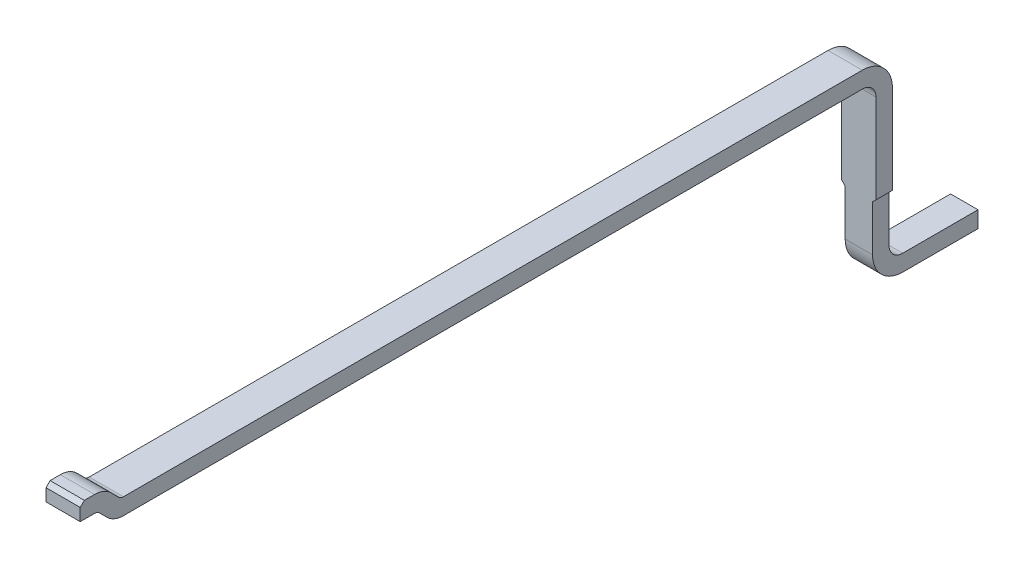
ISO-10303-21;
HEADER;
FILE_DESCRIPTION(('STEP AP214'),'2;1');
FILE_NAME('part.step','',(''),(''),'','','');
FILE_SCHEMA(('AUTOMOTIVE_DESIGN { 1 0 10303 214 1 1 1 1 }'));
ENDSEC;
DATA;
#1=APPLICATION_CONTEXT('core data for automotive mechanical design processes');
#2=APPLICATION_PROTOCOL_DEFINITION('international standard','automotive_design',2000,#1);
#3=PRODUCT_CONTEXT('',#1,'mechanical');
#4=PRODUCT('Part','Part','',(#3));
#5=PRODUCT_RELATED_PRODUCT_CATEGORY('part','',(#4));
#6=PRODUCT_DEFINITION_FORMATION('','',#4);
#7=PRODUCT_DEFINITION_CONTEXT('part definition',#1,'design');
#8=PRODUCT_DEFINITION('design','',#6,#7);
#9=PRODUCT_DEFINITION_SHAPE('','',#8);
#10=(LENGTH_UNIT() NAMED_UNIT(*) SI_UNIT(.MILLI.,.METRE.));
#11=(NAMED_UNIT(*) PLANE_ANGLE_UNIT() SI_UNIT($,.RADIAN.));
#12=(NAMED_UNIT(*) SI_UNIT($,.STERADIAN.) SOLID_ANGLE_UNIT());
#13=UNCERTAINTY_MEASURE_WITH_UNIT(LENGTH_MEASURE(1.E-05),#10,'distance_accuracy_value','');
#14=(GEOMETRIC_REPRESENTATION_CONTEXT(3) GLOBAL_UNCERTAINTY_ASSIGNED_CONTEXT((#13)) GLOBAL_UNIT_ASSIGNED_CONTEXT((#10,
#11,#12)) REPRESENTATION_CONTEXT('',''));
#15=CARTESIAN_POINT('',(0.,0.,0.));
#16=DIRECTION('',(0.,0.,1.));
#17=DIRECTION('',(1.,0.,0.));
#18=AXIS2_PLACEMENT_3D('',#15,#16,#17);
#19=CARTESIAN_POINT('',(0.,12.81951558355,0.));
#20=DIRECTION('',(0.,-1.,0.));
#21=DIRECTION('',(0.,0.,-1.));
#22=AXIS2_PLACEMENT_3D('',#19,#20,#21);
#23=PLANE('',#22);
#24=DIRECTION('',(0.,0.,-1.));
#25=VECTOR('',#24,1.);
#26=CARTESIAN_POINT('',(15.16210820689,12.81951558355,-5.731698833076));
#27=LINE('',#26,#25);
#28=CARTESIAN_POINT('',(15.1621082061497,12.81951558355,-5.77711513867904));
#29=VERTEX_POINT('',#28);
#30=CARTESIAN_POINT('',(15.1621081757249,12.81951558355,-11.17169883308));
#31=VERTEX_POINT('',#30);
#32=EDGE_CURVE('E332',#29,#31,#27,.T.);
#33=ORIENTED_EDGE('',*,*,#32,.T.);
#34=DIRECTION('',(1.,0.,0.));
#35=VECTOR('',#34,1.);
#36=CARTESIAN_POINT('',(0.,12.81951558355,-11.17169883308));
#37=LINE('',#36,#35);
#38=CARTESIAN_POINT('',(15.4121081757445,12.81951558355,-11.17169883308));
#39=VERTEX_POINT('',#38);
#40=EDGE_CURVE('E370',#31,#39,#37,.T.);
#41=ORIENTED_EDGE('',*,*,#40,.T.);
#42=DIRECTION('',(0.,0.,-1.));
#43=VECTOR('',#42,1.);
#44=CARTESIAN_POINT('',(15.41210820689,12.81951558355,-12.98169883308));
#45=LINE('',#44,#43);
#46=CARTESIAN_POINT('',(15.4121082061497,12.81951558355,-5.77711513867904));
#47=VERTEX_POINT('',#46);
#48=EDGE_CURVE('E427',#47,#39,#45,.T.);
#49=ORIENTED_EDGE('',*,*,#48,.F.);
#50=DIRECTION('',(-1.,0.,0.));
#51=VECTOR('',#50,1.);
#52=CARTESIAN_POINT('',(0.,12.81951558355,-5.777115138679));
#53=LINE('',#52,#51);
#54=EDGE_CURVE('E41',#47,#29,#53,.T.);
#55=ORIENTED_EDGE('',*,*,#54,.T.);
#56=EDGE_LOOP('',(#33,#41,#49,#55));
#57=FACE_BOUND('',#56,.T.);
#58=ADVANCED_FACE('F17',(#57),#23,.T.);
#59=CARTESIAN_POINT('',(12.51210817501,12.93951558355,-11.38169883308));
#60=DIRECTION('',(0.,-1.,0.));
#61=DIRECTION('',(0.,0.,-1.));
#62=AXIS2_PLACEMENT_3D('',#59,#60,#61);
#63=PLANE('',#62);
#64=DIRECTION('',(0.,0.,-1.));
#65=VECTOR('',#64,1.);
#66=CARTESIAN_POINT('',(15.16210820689,12.93951558355,-11.38169883308));
#67=LINE('',#66,#65);
#68=CARTESIAN_POINT('',(15.1621082061497,12.93951558355,-5.77711513867901));
#69=VERTEX_POINT('',#68);
#70=CARTESIAN_POINT('',(15.1621081757249,12.93951558355,-11.17169883308));
#71=VERTEX_POINT('',#70);
#72=EDGE_CURVE('E374',#69,#71,#67,.T.);
#73=ORIENTED_EDGE('',*,*,#72,.F.);
#74=DIRECTION('',(-1.,0.,0.));
#75=VECTOR('',#74,1.);
#76=CARTESIAN_POINT('',(12.51210817501,12.93951558355,-5.777115138679));
#77=LINE('',#76,#75);
#78=CARTESIAN_POINT('',(15.4121082061497,12.93951558355,-5.77711513867901));
#79=VERTEX_POINT('',#78);
#80=EDGE_CURVE('E11',#79,#69,#77,.T.);
#81=ORIENTED_EDGE('',*,*,#80,.F.);
#82=DIRECTION('',(0.,0.,1.));
#83=VECTOR('',#82,1.);
#84=CARTESIAN_POINT('',(15.41210820689,12.93951558355,-12.98169883308));
#85=LINE('',#84,#83);
#86=CARTESIAN_POINT('',(15.4121081757445,12.93951558355,-11.17169883308));
#87=VERTEX_POINT('',#86);
#88=EDGE_CURVE('E286',#87,#79,#85,.T.);
#89=ORIENTED_EDGE('',*,*,#88,.F.);
#90=DIRECTION('',(-1.,0.,0.));
#91=VECTOR('',#90,1.);
#92=CARTESIAN_POINT('',(13.11210817501,12.93951558355,-11.17169883308));
#93=LINE('',#92,#91);
#94=EDGE_CURVE('E423',#87,#71,#93,.T.);
#95=ORIENTED_EDGE('',*,*,#94,.T.);
#96=EDGE_LOOP('',(#73,#81,#89,#95));
#97=FACE_BOUND('',#96,.T.);
#98=ADVANCED_FACE('F761',(#97),#63,.F.);
#99=CARTESIAN_POINT('',(12.51210817501,12.98951558355,-5.777115138679));
#100=DIRECTION('',(1.,0.,0.));
#101=DIRECTION('',(0.,0.,1.));
#102=AXIS2_PLACEMENT_3D('',#99,#100,#101);
#103=CYLINDRICAL_SURFACE('',#102,0.05);
#104=ORIENTED_EDGE('',*,*,#80,.T.);
#105=CARTESIAN_POINT('',(15.16210820689,12.98951558355,-5.777115138679));
#106=DIRECTION('',(-1.,0.,0.));
#107=DIRECTION('',(0.,0.,1.));
#108=AXIS2_PLACEMENT_3D('',#105,#106,#107);
#109=CIRCLE('',#108,0.05);
#110=CARTESIAN_POINT('',(15.1621082061497,12.9541602444904,-5.74175979962039));
#111=VERTEX_POINT('',#110);
#112=EDGE_CURVE('E363',#69,#111,#109,.T.);
#113=ORIENTED_EDGE('',*,*,#112,.T.);
#114=DIRECTION('',(-1.,0.,0.));
#115=VECTOR('',#114,1.);
#116=CARTESIAN_POINT('',(16.91210820408,12.954160244491,-5.741759799621));
#117=LINE('',#116,#115);
#118=CARTESIAN_POINT('',(15.4121082061497,12.9541602444904,-5.74175979962039));
#119=VERTEX_POINT('',#118);
#120=EDGE_CURVE('E27',#119,#111,#117,.T.);
#121=ORIENTED_EDGE('',*,*,#120,.F.);
#122=CARTESIAN_POINT('',(15.41210820689,12.98951558355,-5.777115138679));
#123=DIRECTION('',(-1.,0.,0.));
#124=DIRECTION('',(0.,0.,1.));
#125=AXIS2_PLACEMENT_3D('',#122,#123,#124);
#126=CIRCLE('',#125,0.05);
#127=EDGE_CURVE('E281',#79,#119,#126,.T.);
#128=ORIENTED_EDGE('',*,*,#127,.F.);
#129=EDGE_LOOP('',(#104,#113,#121,#128));
#130=FACE_BOUND('',#129,.T.);
#131=ADVANCED_FACE('F745',(#130),#103,.F.);
#132=CARTESIAN_POINT('',(16.91210820408,12.93951558355,-5.756404460561));
#133=DIRECTION('',(0.,0.707106781186548,-0.707106781186548));
#134=DIRECTION('',(-1.,0.,0.));
#135=AXIS2_PLACEMENT_3D('',#132,#133,#134);
#136=PLANE('',#135);
#137=DIRECTION('',(-1.,0.,0.));
#138=VECTOR('',#137,1.);
#139=CARTESIAN_POINT('',(16.91210820408,13.009723736351,-5.68619630776));
#140=LINE('',#139,#138);
#141=CARTESIAN_POINT('',(15.4121082061497,13.0097237363508,-5.68619630775936));
#142=VERTEX_POINT('',#141);
#143=CARTESIAN_POINT('',(15.1621082061497,13.0097237363508,-5.68619630775937));
#144=VERTEX_POINT('',#143);
#145=EDGE_CURVE('E152',#142,#144,#140,.T.);
#146=ORIENTED_EDGE('',*,*,#145,.F.);
#147=DIRECTION('',(0.,0.707106781180048,0.707106781193047));
#148=VECTOR('',#147,1.);
#149=CARTESIAN_POINT('',(15.41210820689,12.95416024449,-5.74175979962));
#150=LINE('',#149,#148);
#151=EDGE_CURVE('E285',#119,#142,#150,.T.);
#152=ORIENTED_EDGE('',*,*,#151,.F.);
#153=ORIENTED_EDGE('',*,*,#120,.T.);
#154=DIRECTION('',(0.,0.707106781180048,0.707106781193047));
#155=VECTOR('',#154,1.);
#156=CARTESIAN_POINT('',(15.16210820689,12.95416024449,-5.74175979962));
#157=LINE('',#156,#155);
#158=EDGE_CURVE('E335',#111,#144,#157,.T.);
#159=ORIENTED_EDGE('',*,*,#158,.T.);
#160=EDGE_LOOP('',(#146,#152,#153,#159));
#161=FACE_BOUND('',#160,.T.);
#162=ADVANCED_FACE('F741',(#161),#136,.T.);
#163=CARTESIAN_POINT('',(16.91210820408,12.88951558355,-5.565988154957));
#164=DIRECTION('',(1.,0.,0.));
#165=DIRECTION('',(0.,0.,1.));
#166=AXIS2_PLACEMENT_3D('',#163,#164,#165);
#167=CYLINDRICAL_SURFACE('',#166,0.17);
#168=DIRECTION('',(-1.,0.,0.));
#169=VECTOR('',#168,1.);
#170=CARTESIAN_POINT('',(16.91210820408,13.05951558355,-5.565988154957));
#171=LINE('',#170,#169);
#172=CARTESIAN_POINT('',(15.4121082061497,13.05951558355,-5.565988154957));
#173=VERTEX_POINT('',#172);
#174=CARTESIAN_POINT('',(15.1621082061497,13.05951558355,-5.56598815495699));
#175=VERTEX_POINT('',#174);
#176=EDGE_CURVE('E163',#173,#175,#171,.T.);
#177=ORIENTED_EDGE('',*,*,#176,.F.);
#178=CARTESIAN_POINT('',(15.41210820689,12.88951558355,-5.565988154957));
#179=DIRECTION('',(1.,0.,0.));
#180=DIRECTION('',(0.,0.,1.));
#181=AXIS2_PLACEMENT_3D('',#178,#179,#180);
#182=CIRCLE('',#181,0.17);
#183=EDGE_CURVE('E342',#142,#173,#182,.T.);
#184=ORIENTED_EDGE('',*,*,#183,.F.);
#185=ORIENTED_EDGE('',*,*,#145,.T.);
#186=CARTESIAN_POINT('',(15.16210820689,12.88951558355,-5.565988154957));
#187=DIRECTION('',(1.,0.,0.));
#188=DIRECTION('',(0.,0.,1.));
#189=AXIS2_PLACEMENT_3D('',#186,#187,#188);
#190=CIRCLE('',#189,0.17);
#191=EDGE_CURVE('E264',#144,#175,#190,.T.);
#192=ORIENTED_EDGE('',*,*,#191,.T.);
#193=EDGE_LOOP('',(#177,#184,#185,#192));
#194=FACE_BOUND('',#193,.T.);
#195=ADVANCED_FACE('F747',(#194),#167,.T.);
#196=CARTESIAN_POINT('',(16.91210820408,13.05951558355,-5.661404460561));
#197=DIRECTION('',(0.,1.,0.));
#198=DIRECTION('',(1.,0.,0.));
#199=AXIS2_PLACEMENT_3D('',#196,#197,#198);
#200=PLANE('',#199);
#201=ORIENTED_EDGE('',*,*,#176,.T.);
#202=DIRECTION('',(0.,0.,1.));
#203=VECTOR('',#202,1.);
#204=CARTESIAN_POINT('',(15.16210820689,13.05951558355,-5.731698833076));
#205=LINE('',#204,#203);
#206=CARTESIAN_POINT('',(15.1621082061497,13.05951558355,-5.491404460561));
#207=VERTEX_POINT('',#206);
#208=EDGE_CURVE('E259',#175,#207,#205,.T.);
#209=ORIENTED_EDGE('',*,*,#208,.T.);
#210=DIRECTION('',(1.,0.,0.));
#211=VECTOR('',#210,1.);
#212=CARTESIAN_POINT('',(16.91210820408,13.05951558355,-5.491404460561));
#213=LINE('',#212,#211);
#214=CARTESIAN_POINT('',(15.4121082061497,13.05951558355,-5.491404460561));
#215=VERTEX_POINT('',#214);
#216=EDGE_CURVE('E246',#207,#215,#213,.T.);
#217=ORIENTED_EDGE('',*,*,#216,.T.);
#218=DIRECTION('',(0.,0.,1.));
#219=VECTOR('',#218,1.);
#220=CARTESIAN_POINT('',(15.41210820689,13.05951558355,-12.98169883308));
#221=LINE('',#220,#219);
#222=EDGE_CURVE('E346',#173,#215,#221,.T.);
#223=ORIENTED_EDGE('',*,*,#222,.F.);
#224=EDGE_LOOP('',(#201,#209,#217,#223));
#225=FACE_BOUND('',#224,.T.);
#226=ADVANCED_FACE('F260',(#225),#200,.T.);
#227=CARTESIAN_POINT('',(16.91210820408,13.05951558355,-5.491404460561));
#228=DIRECTION('',(0.,-0.707106781187048,-0.707106781186048));
#229=DIRECTION('',(0.,0.707106781186048,-0.707106781187048));
#230=AXIS2_PLACEMENT_3D('',#227,#228,#229);
#231=PLANE('',#230);
#232=DIRECTION('',(-1.,0.,0.));
#233=VECTOR('',#232,1.);
#234=CARTESIAN_POINT('',(16.91210820408,13.02951558355,-5.461404460561));
#235=LINE('',#234,#233);
#236=CARTESIAN_POINT('',(15.4121082061497,13.02951558355,-5.461404460561));
#237=VERTEX_POINT('',#236);
#238=CARTESIAN_POINT('',(15.1621082061497,13.02951558355,-5.461404460561));
#239=VERTEX_POINT('',#238);
#240=EDGE_CURVE('E240',#237,#239,#235,.T.);
#241=ORIENTED_EDGE('',*,*,#240,.F.);
#242=DIRECTION('',(0.,-0.707106781186548,0.707106781186548));
#243=VECTOR('',#242,1.);
#244=CARTESIAN_POINT('',(15.41210820689,13.05951558355,-5.491404460561));
#245=LINE('',#244,#243);
#246=EDGE_CURVE('E253',#215,#237,#245,.T.);
#247=ORIENTED_EDGE('',*,*,#246,.F.);
#248=ORIENTED_EDGE('',*,*,#216,.F.);
#249=DIRECTION('',(0.,-0.707106781186548,0.707106781186548));
#250=VECTOR('',#249,1.);
#251=CARTESIAN_POINT('',(15.16210820689,13.05951558355,-5.491404460561));
#252=LINE('',#251,#250);
#253=EDGE_CURVE('E250',#207,#239,#252,.T.);
#254=ORIENTED_EDGE('',*,*,#253,.T.);
#255=EDGE_LOOP('',(#241,#247,#248,#254));
#256=FACE_BOUND('',#255,.T.);
#257=ADVANCED_FACE('F248',(#256),#231,.F.);
#258=CARTESIAN_POINT('',(16.91210820408,13.05951558355,-5.461404460561));
#259=DIRECTION('',(0.,0.,1.));
#260=DIRECTION('',(1.,0.,0.));
#261=AXIS2_PLACEMENT_3D('',#258,#259,#260);
#262=PLANE('',#261);
#263=DIRECTION('',(1.,0.,0.));
#264=VECTOR('',#263,1.);
#265=CARTESIAN_POINT('',(17.5653424523,12.93951558355,-5.461404460561));
#266=LINE('',#265,#264);
#267=CARTESIAN_POINT('',(15.1621082061497,12.93951558355,-5.46140446056099));
#268=VERTEX_POINT('',#267);
#269=CARTESIAN_POINT('',(15.4121082061497,12.93951558355,-5.461404460561));
#270=VERTEX_POINT('',#269);
#271=EDGE_CURVE('E304',#268,#270,#266,.T.);
#272=ORIENTED_EDGE('',*,*,#271,.T.);
#273=DIRECTION('',(0.,-1.,0.));
#274=VECTOR('',#273,1.);
#275=CARTESIAN_POINT('',(15.41210820689,12.65951558355,-5.461404460561));
#276=LINE('',#275,#274);
#277=EDGE_CURVE('E390',#237,#270,#276,.T.);
#278=ORIENTED_EDGE('',*,*,#277,.F.);
#279=ORIENTED_EDGE('',*,*,#240,.T.);
#280=DIRECTION('',(0.,-1.,0.));
#281=VECTOR('',#280,1.);
#282=CARTESIAN_POINT('',(15.16210820689,12.93951558355,-5.461404460561));
#283=LINE('',#282,#281);
#284=EDGE_CURVE('E269',#239,#268,#283,.T.);
#285=ORIENTED_EDGE('',*,*,#284,.T.);
#286=EDGE_LOOP('',(#272,#278,#279,#285));
#287=FACE_BOUND('',#286,.T.);
#288=ADVANCED_FACE('F505',(#287),#262,.T.);
#289=CARTESIAN_POINT('',(17.5653424523,12.93951558355,-5.535988154957));
#290=DIRECTION('',(0.,1.,-1.444831928366E-13));
#291=DIRECTION('',(0.,-1.444831928366E-13,-1.));
#292=AXIS2_PLACEMENT_3D('',#289,#290,#291);
#293=PLANE('',#292);
#294=DIRECTION('',(0.,0.,-1.));
#295=VECTOR('',#294,1.);
#296=CARTESIAN_POINT('',(15.41210820689,12.93951558355,-12.98169883308));
#297=LINE('',#296,#295);
#298=CARTESIAN_POINT('',(15.4121082061497,12.93951558355,-5.565988154957));
#299=VERTEX_POINT('',#298);
#300=EDGE_CURVE('E341',#270,#299,#297,.T.);
#301=ORIENTED_EDGE('',*,*,#300,.F.);
#302=ORIENTED_EDGE('',*,*,#271,.F.);
#303=DIRECTION('',(0.,0.,-1.));
#304=VECTOR('',#303,1.);
#305=CARTESIAN_POINT('',(15.16210820689,12.93951558355,-5.731698833076));
#306=LINE('',#305,#304);
#307=CARTESIAN_POINT('',(15.1621082061497,12.93951558355,-5.56598815495699));
#308=VERTEX_POINT('',#307);
#309=EDGE_CURVE('E276',#268,#308,#306,.T.);
#310=ORIENTED_EDGE('',*,*,#309,.T.);
#311=DIRECTION('',(1.,0.,0.));
#312=VECTOR('',#311,1.);
#313=CARTESIAN_POINT('',(16.91210820408,12.93951558355,-5.565988154957));
#314=LINE('',#313,#312);
#315=EDGE_CURVE('E290',#308,#299,#314,.T.);
#316=ORIENTED_EDGE('',*,*,#315,.T.);
#317=EDGE_LOOP('',(#301,#302,#310,#316));
#318=FACE_BOUND('',#317,.T.);
#319=ADVANCED_FACE('F501',(#318),#293,.F.);
#320=CARTESIAN_POINT('',(16.91210820408,12.88951558355,-5.565988154957));
#321=DIRECTION('',(1.,0.,0.));
#322=DIRECTION('',(0.,0.,1.));
#323=AXIS2_PLACEMENT_3D('',#320,#321,#322);
#324=CYLINDRICAL_SURFACE('',#323,0.05);
#325=ORIENTED_EDGE('',*,*,#315,.F.);
#326=CARTESIAN_POINT('',(15.16210820689,12.88951558355,-5.565988154957));
#327=DIRECTION('',(-1.,0.,0.));
#328=DIRECTION('',(0.,0.,1.));
#329=AXIS2_PLACEMENT_3D('',#326,#327,#328);
#330=CIRCLE('',#329,0.05);
#331=CARTESIAN_POINT('',(15.1621082061497,12.9248709226098,-5.60134349401677));
#332=VERTEX_POINT('',#331);
#333=EDGE_CURVE('E386',#308,#332,#330,.T.);
#334=ORIENTED_EDGE('',*,*,#333,.T.);
#335=DIRECTION('',(-1.,0.,0.));
#336=VECTOR('',#335,1.);
#337=CARTESIAN_POINT('',(16.91210820408,12.92487092261,-5.601343494017));
#338=LINE('',#337,#336);
#339=CARTESIAN_POINT('',(15.4121082061497,12.9248709226098,-5.60134349401677));
#340=VERTEX_POINT('',#339);
#341=EDGE_CURVE('E287',#340,#332,#338,.T.);
#342=ORIENTED_EDGE('',*,*,#341,.F.);
#343=CARTESIAN_POINT('',(15.41210820689,12.88951558355,-5.565988154957));
#344=DIRECTION('',(-1.,0.,0.));
#345=DIRECTION('',(0.,0.,1.));
#346=AXIS2_PLACEMENT_3D('',#343,#344,#345);
#347=CIRCLE('',#346,0.05);
#348=EDGE_CURVE('E336',#299,#340,#347,.T.);
#349=ORIENTED_EDGE('',*,*,#348,.F.);
#350=EDGE_LOOP('',(#325,#334,#342,#349));
#351=FACE_BOUND('',#350,.T.);
#352=ADVANCED_FACE('F788',(#351),#324,.F.);
#353=CARTESIAN_POINT('',(16.91210820408,12.93951558355,-5.586698833076));
#354=DIRECTION('',(0.,-0.707106781186048,0.707106781187048));
#355=DIRECTION('',(-1.,0.,0.));
#356=AXIS2_PLACEMENT_3D('',#353,#354,#355);
#357=PLANE('',#356);
#358=ORIENTED_EDGE('',*,*,#341,.T.);
#359=DIRECTION('',(0.,-0.707106781180048,-0.707106781193047));
#360=VECTOR('',#359,1.);
#361=CARTESIAN_POINT('',(15.16210820689,12.92487092261,-5.601343494017));
#362=LINE('',#361,#360);
#363=CARTESIAN_POINT('',(15.1621082061497,12.8693074307492,-5.65690698587737));
#364=VERTEX_POINT('',#363);
#365=EDGE_CURVE('E331',#332,#364,#362,.T.);
#366=ORIENTED_EDGE('',*,*,#365,.T.);
#367=DIRECTION('',(-1.,0.,0.));
#368=VECTOR('',#367,1.);
#369=CARTESIAN_POINT('',(13.06210817501,12.869307430749,-5.656906985877));
#370=LINE('',#369,#368);
#371=CARTESIAN_POINT('',(15.4121082061497,12.8693074307492,-5.65690698587737));
#372=VERTEX_POINT('',#371);
#373=EDGE_CURVE('E20',#372,#364,#370,.T.);
#374=ORIENTED_EDGE('',*,*,#373,.F.);
#375=DIRECTION('',(0.,-0.707106781180048,-0.707106781193047));
#376=VECTOR('',#375,1.);
#377=CARTESIAN_POINT('',(15.41210820689,12.92487092261,-5.601343494017));
#378=LINE('',#377,#376);
#379=EDGE_CURVE('E340',#340,#372,#378,.T.);
#380=ORIENTED_EDGE('',*,*,#379,.F.);
#381=EDGE_LOOP('',(#358,#366,#374,#380));
#382=FACE_BOUND('',#381,.T.);
#383=ADVANCED_FACE('F786',(#382),#357,.T.);
#384=CARTESIAN_POINT('',(13.06210817501,12.98951558355,-5.777115138679));
#385=DIRECTION('',(1.,0.,0.));
#386=DIRECTION('',(0.,0.,1.));
#387=AXIS2_PLACEMENT_3D('',#384,#385,#386);
#388=CYLINDRICAL_SURFACE('',#387,0.17);
#389=ORIENTED_EDGE('',*,*,#54,.F.);
#390=CARTESIAN_POINT('',(15.41210820689,12.98951558355,-5.777115138679));
#391=DIRECTION('',(1.,0.,0.));
#392=DIRECTION('',(0.,0.,1.));
#393=AXIS2_PLACEMENT_3D('',#390,#391,#392);
#394=CIRCLE('',#393,0.17);
#395=EDGE_CURVE('E445',#372,#47,#394,.T.);
#396=ORIENTED_EDGE('',*,*,#395,.F.);
#397=ORIENTED_EDGE('',*,*,#373,.T.);
#398=CARTESIAN_POINT('',(15.16210820689,12.98951558355,-5.777115138679));
#399=DIRECTION('',(1.,0.,0.));
#400=DIRECTION('',(0.,0.,1.));
#401=AXIS2_PLACEMENT_3D('',#398,#399,#400);
#402=CIRCLE('',#401,0.17);
#403=EDGE_CURVE('E328',#364,#29,#402,.T.);
#404=ORIENTED_EDGE('',*,*,#403,.T.);
#405=EDGE_LOOP('',(#389,#396,#397,#404));
#406=FACE_BOUND('',#405,.T.);
#407=ADVANCED_FACE('F784',(#406),#388,.T.);
#408=CARTESIAN_POINT('',(12.81210814532,12.71951558355,-11.17169883308));
#409=DIRECTION('',(1.,0.,0.));
#410=DIRECTION('',(0.,0.,1.));
#411=AXIS2_PLACEMENT_3D('',#408,#409,#410);
#412=CYLINDRICAL_SURFACE('',#411,0.22);
#413=ORIENTED_EDGE('',*,*,#94,.F.);
#414=CARTESIAN_POINT('',(15.41210814532,12.71951558355,-11.17169883308));
#415=DIRECTION('',(-1.,0.,0.));
#416=DIRECTION('',(0.,0.,1.));
#417=AXIS2_PLACEMENT_3D('',#414,#415,#416);
#418=CIRCLE('',#417,0.22);
#419=CARTESIAN_POINT('',(15.41210814532,12.71951558355,-11.39169883308));
#420=VERTEX_POINT('',#419);
#421=EDGE_CURVE('E359',#87,#420,#418,.T.);
#422=ORIENTED_EDGE('',*,*,#421,.T.);
#423=DIRECTION('',(-1.,0.,0.));
#424=VECTOR('',#423,1.);
#425=CARTESIAN_POINT('',(12.81210814532,12.71951558355,-11.39169883308));
#426=LINE('',#425,#424);
#427=CARTESIAN_POINT('',(15.16210814532,12.71951558355,-11.39169883308));
#428=VERTEX_POINT('',#427);
#429=EDGE_CURVE('E395',#420,#428,#426,.T.);
#430=ORIENTED_EDGE('',*,*,#429,.T.);
#431=CARTESIAN_POINT('',(15.16210814532,12.71951558355,-11.17169883308));
#432=DIRECTION('',(-1.,0.,0.));
#433=DIRECTION('',(0.,0.,1.));
#434=AXIS2_PLACEMENT_3D('',#431,#432,#433);
#435=CIRCLE('',#434,0.22);
#436=EDGE_CURVE('E418',#71,#428,#435,.T.);
#437=ORIENTED_EDGE('',*,*,#436,.F.);
#438=EDGE_LOOP('',(#413,#422,#430,#437));
#439=FACE_BOUND('',#438,.T.);
#440=ADVANCED_FACE('F800',(#439),#412,.T.);
#441=CARTESIAN_POINT('',(15.41210814532,12.93951558355,-10.71169883308));
#442=DIRECTION('',(1.,0.,0.));
#443=DIRECTION('',(0.,0.,-1.));
#444=AXIS2_PLACEMENT_3D('',#441,#442,#443);
#445=PLANE('',#444);
#446=ORIENTED_EDGE('',*,*,#421,.F.);
#447=ORIENTED_EDGE('',*,*,#88,.T.);
#448=ORIENTED_EDGE('',*,*,#127,.T.);
#449=ORIENTED_EDGE('',*,*,#151,.T.);
#450=ORIENTED_EDGE('',*,*,#183,.T.);
#451=ORIENTED_EDGE('',*,*,#222,.T.);
#452=ORIENTED_EDGE('',*,*,#246,.T.);
#453=ORIENTED_EDGE('',*,*,#277,.T.);
#454=ORIENTED_EDGE('',*,*,#300,.T.);
#455=ORIENTED_EDGE('',*,*,#348,.T.);
#456=ORIENTED_EDGE('',*,*,#379,.T.);
#457=ORIENTED_EDGE('',*,*,#395,.T.);
#458=ORIENTED_EDGE('',*,*,#48,.T.);
#459=CARTESIAN_POINT('',(15.41210814532,12.71951558355,-11.17169883308));
#460=DIRECTION('',(-1.,0.,0.));
#461=DIRECTION('',(0.,0.,-1.));
#462=AXIS2_PLACEMENT_3D('',#459,#460,#461);
#463=CIRCLE('',#462,0.1);
#464=CARTESIAN_POINT('',(15.41210814532,12.71951558355,-11.27169883308));
#465=VERTEX_POINT('',#464);
#466=EDGE_CURVE('E326',#39,#465,#463,.T.);
#467=ORIENTED_EDGE('',*,*,#466,.T.);
#468=DIRECTION('',(0.,-1.,0.));
#469=VECTOR('',#468,1.);
#470=CARTESIAN_POINT('',(15.41210814532,12.93951558355,-11.27169883308));
#471=LINE('',#470,#469);
#472=CARTESIAN_POINT('',(15.41210814532,12.06951558355,-11.27169883308));
#473=VERTEX_POINT('',#472);
#474=EDGE_CURVE('E309',#465,#473,#471,.T.);
#475=ORIENTED_EDGE('',*,*,#474,.T.);
#476=DIRECTION('',(0.,0.,-1.));
#477=VECTOR('',#476,1.);
#478=CARTESIAN_POINT('',(15.41210814532,12.06951558355,-10.71169883308));
#479=LINE('',#478,#477);
#480=CARTESIAN_POINT('',(15.41210814532,12.06951558355,-11.39169883308));
#481=VERTEX_POINT('',#480);
#482=EDGE_CURVE('E310',#473,#481,#479,.T.);
#483=ORIENTED_EDGE('',*,*,#482,.T.);
#484=DIRECTION('',(0.,1.,0.));
#485=VECTOR('',#484,1.);
#486=CARTESIAN_POINT('',(15.41210814532,12.93951558355,-11.39169883308));
#487=LINE('',#486,#485);
#488=EDGE_CURVE('E466',#481,#420,#487,.T.);
#489=ORIENTED_EDGE('',*,*,#488,.T.);
#490=EDGE_LOOP('',(#446,#447,#448,#449,#450,#451,#452,#453,#454,#455,#456,#457,#458,#467,#475,
#483,#489));
#491=FACE_BOUND('',#490,.T.);
#492=ADVANCED_FACE('F498',(#491),#445,.T.);
#493=CARTESIAN_POINT('',(15.16210814532,12.93951558355,-11.91169883308));
#494=DIRECTION('',(-1.,0.,0.));
#495=DIRECTION('',(0.,1.,0.));
#496=AXIS2_PLACEMENT_3D('',#493,#494,#495);
#497=PLANE('',#496);
#498=ORIENTED_EDGE('',*,*,#72,.T.);
#499=ORIENTED_EDGE('',*,*,#436,.T.);
#500=DIRECTION('',(0.,-1.,0.));
#501=VECTOR('',#500,1.);
#502=CARTESIAN_POINT('',(15.16210814532,12.93951558355,-11.39169883308));
#503=LINE('',#502,#501);
#504=CARTESIAN_POINT('',(15.16210814532,12.06951558355,-11.39169883308));
#505=VERTEX_POINT('',#504);
#506=EDGE_CURVE('E403',#428,#505,#503,.T.);
#507=ORIENTED_EDGE('',*,*,#506,.T.);
#508=DIRECTION('',(0.,0.,1.));
#509=VECTOR('',#508,1.);
#510=CARTESIAN_POINT('',(15.16210814532,12.06951558355,-11.91169883308));
#511=LINE('',#510,#509);
#512=CARTESIAN_POINT('',(15.16210814532,12.06951558355,-11.27169883308));
#513=VERTEX_POINT('',#512);
#514=EDGE_CURVE('E295',#505,#513,#511,.T.);
#515=ORIENTED_EDGE('',*,*,#514,.T.);
#516=DIRECTION('',(0.,1.,0.));
#517=VECTOR('',#516,1.);
#518=CARTESIAN_POINT('',(15.16210814532,12.93951558355,-11.27169883308));
#519=LINE('',#518,#517);
#520=CARTESIAN_POINT('',(15.16210814532,12.71951558355,-11.27169883308));
#521=VERTEX_POINT('',#520);
#522=EDGE_CURVE('E327',#513,#521,#519,.T.);
#523=ORIENTED_EDGE('',*,*,#522,.T.);
#524=CARTESIAN_POINT('',(15.16210814532,12.71951558355,-11.17169883308));
#525=DIRECTION('',(1.,0.,0.));
#526=DIRECTION('',(0.,0.,-1.));
#527=AXIS2_PLACEMENT_3D('',#524,#525,#526);
#528=CIRCLE('',#527,0.1);
#529=EDGE_CURVE('E322',#521,#31,#528,.T.);
#530=ORIENTED_EDGE('',*,*,#529,.T.);
#531=ORIENTED_EDGE('',*,*,#32,.F.);
#532=ORIENTED_EDGE('',*,*,#403,.F.);
#533=ORIENTED_EDGE('',*,*,#365,.F.);
#534=ORIENTED_EDGE('',*,*,#333,.F.);
#535=ORIENTED_EDGE('',*,*,#309,.F.);
#536=ORIENTED_EDGE('',*,*,#284,.F.);
#537=ORIENTED_EDGE('',*,*,#253,.F.);
#538=ORIENTED_EDGE('',*,*,#208,.F.);
#539=ORIENTED_EDGE('',*,*,#191,.F.);
#540=ORIENTED_EDGE('',*,*,#158,.F.);
#541=ORIENTED_EDGE('',*,*,#112,.F.);
#542=EDGE_LOOP('',(#498,#499,#507,#515,#523,#530,#531,#532,#533,#534,#535,#536,#537,#538,#539,
#540,#541));
#543=FACE_BOUND('',#542,.T.);
#544=ADVANCED_FACE('F267',(#543),#497,.T.);
#545=CARTESIAN_POINT('',(19.01210814532,12.71951558355,-11.17169883308));
#546=DIRECTION('',(-1.,0.,0.));
#547=DIRECTION('',(0.,0.,-1.));
#548=AXIS2_PLACEMENT_3D('',#545,#546,#547);
#549=CYLINDRICAL_SURFACE('',#548,0.1);
#550=ORIENTED_EDGE('',*,*,#529,.F.);
#551=DIRECTION('',(-1.,0.,0.));
#552=VECTOR('',#551,1.);
#553=CARTESIAN_POINT('',(19.01210814532,12.71951558355,-11.27169883308));
#554=LINE('',#553,#552);
#555=EDGE_CURVE('E382',#465,#521,#554,.T.);
#556=ORIENTED_EDGE('',*,*,#555,.F.);
#557=ORIENTED_EDGE('',*,*,#466,.F.);
#558=ORIENTED_EDGE('',*,*,#40,.F.);
#559=EDGE_LOOP('',(#550,#556,#557,#558));
#560=FACE_BOUND('',#559,.T.);
#561=ADVANCED_FACE('F775',(#560),#549,.F.);
#562=CARTESIAN_POINT('',(15.16210814532,11.48951558355,-11.27169883308));
#563=DIRECTION('',(0.,0.,1.));
#564=DIRECTION('',(1.,0.,0.));
#565=AXIS2_PLACEMENT_3D('',#562,#563,#564);
#566=PLANE('',#565);
#567=DIRECTION('',(0.,1.,0.));
#568=VECTOR('',#567,1.);
#569=CARTESIAN_POINT('',(15.38710814532,11.48951558355,-11.27169883308));
#570=LINE('',#569,#568);
#571=CARTESIAN_POINT('',(15.38710814532,11.70951558355,-11.27169883308));
#572=VERTEX_POINT('',#571);
#573=CARTESIAN_POINT('',(15.38710814532,12.04451558355,-11.27169883308));
#574=VERTEX_POINT('',#573);
#575=EDGE_CURVE('E412',#572,#574,#570,.T.);
#576=ORIENTED_EDGE('',*,*,#575,.T.);
#577=DIRECTION('',(0.707106781186548,0.707106781186548,0.));
#578=VECTOR('',#577,1.);
#579=CARTESIAN_POINT('',(15.38710814532,12.04451558355,-11.27169883308));
#580=LINE('',#579,#578);
#581=EDGE_CURVE('E305',#574,#473,#580,.T.);
#582=ORIENTED_EDGE('',*,*,#581,.T.);
#583=ORIENTED_EDGE('',*,*,#474,.F.);
#584=ORIENTED_EDGE('',*,*,#555,.T.);
#585=ORIENTED_EDGE('',*,*,#522,.F.);
#586=DIRECTION('',(0.707106781186548,-0.707106781186548,0.));
#587=VECTOR('',#586,1.);
#588=CARTESIAN_POINT('',(15.16210814532,12.06951558355,-11.27169883308));
#589=LINE('',#588,#587);
#590=CARTESIAN_POINT('',(15.18710814532,12.04451558355,-11.27169883308));
#591=VERTEX_POINT('',#590);
#592=EDGE_CURVE('E294',#513,#591,#589,.T.);
#593=ORIENTED_EDGE('',*,*,#592,.T.);
#594=DIRECTION('',(0.,-1.,0.));
#595=VECTOR('',#594,1.);
#596=CARTESIAN_POINT('',(15.18710814532,11.48951558355,-11.27169883308));
#597=LINE('',#596,#595);
#598=CARTESIAN_POINT('',(15.18710814532,11.70951558355,-11.27169883308));
#599=VERTEX_POINT('',#598);
#600=EDGE_CURVE('E317',#591,#599,#597,.T.);
#601=ORIENTED_EDGE('',*,*,#600,.T.);
#602=DIRECTION('',(1.,0.,0.));
#603=VECTOR('',#602,1.);
#604=CARTESIAN_POINT('',(15.16210814532,11.70951558355,-11.27169883308));
#605=LINE('',#604,#603);
#606=EDGE_CURVE('E296',#599,#572,#605,.T.);
#607=ORIENTED_EDGE('',*,*,#606,.T.);
#608=EDGE_LOOP('',(#576,#582,#583,#584,#585,#593,#601,#607));
#609=FACE_BOUND('',#608,.T.);
#610=ADVANCED_FACE('F781',(#609),#566,.T.);
#611=CARTESIAN_POINT('',(15.38210814532,12.03951558355,-8.041698833076));
#612=DIRECTION('',(-0.707106781186048,0.707106781187048,0.));
#613=DIRECTION('',(0.,0.,1.));
#614=AXIS2_PLACEMENT_3D('',#611,#612,#613);
#615=PLANE('',#614);
#616=DIRECTION('',(0.707106781186548,0.707106781186548,0.));
#617=VECTOR('',#616,1.);
#618=CARTESIAN_POINT('',(15.38710814532,12.04451558355,-11.39169883308));
#619=LINE('',#618,#617);
#620=CARTESIAN_POINT('',(15.38710814532,12.04451558355,-11.39169883308));
#621=VERTEX_POINT('',#620);
#622=EDGE_CURVE('E406',#621,#481,#619,.T.);
#623=ORIENTED_EDGE('',*,*,#622,.T.);
#624=ORIENTED_EDGE('',*,*,#482,.F.);
#625=ORIENTED_EDGE('',*,*,#581,.F.);
#626=DIRECTION('',(0.,0.,1.));
#627=VECTOR('',#626,1.);
#628=CARTESIAN_POINT('',(15.38710814532,12.04451558355,-8.041698833076));
#629=LINE('',#628,#627);
#630=EDGE_CURVE('E315',#621,#574,#629,.T.);
#631=ORIENTED_EDGE('',*,*,#630,.F.);
#632=EDGE_LOOP('',(#623,#624,#625,#631));
#633=FACE_BOUND('',#632,.T.);
#634=ADVANCED_FACE('F808',(#633),#615,.F.);
#635=CARTESIAN_POINT('',(12.81210814532,12.93951558355,-11.39169883308));
#636=DIRECTION('',(0.,0.,1.));
#637=DIRECTION('',(1.,0.,0.));
#638=AXIS2_PLACEMENT_3D('',#635,#636,#637);
#639=PLANE('',#638);
#640=ORIENTED_EDGE('',*,*,#488,.F.);
#641=ORIENTED_EDGE('',*,*,#622,.F.);
#642=DIRECTION('',(0.,1.,0.));
#643=VECTOR('',#642,1.);
#644=CARTESIAN_POINT('',(15.38710814532,12.93951558355,-11.39169883308));
#645=LINE('',#644,#643);
#646=CARTESIAN_POINT('',(15.38710814532,11.70951558355,-11.39169883308));
#647=VERTEX_POINT('',#646);
#648=EDGE_CURVE('E311',#647,#621,#645,.T.);
#649=ORIENTED_EDGE('',*,*,#648,.F.);
#650=DIRECTION('',(1.,0.,0.));
#651=VECTOR('',#650,1.);
#652=CARTESIAN_POINT('',(12.81210814532,11.70951558355,-11.39169883308));
#653=LINE('',#652,#651);
#654=CARTESIAN_POINT('',(15.18710814532,11.70951558355,-11.39169883308));
#655=VERTEX_POINT('',#654);
#656=EDGE_CURVE('E377',#655,#647,#653,.T.);
#657=ORIENTED_EDGE('',*,*,#656,.F.);
#658=DIRECTION('',(0.,-1.,0.));
#659=VECTOR('',#658,1.);
#660=CARTESIAN_POINT('',(15.18710814532,12.93951558355,-11.39169883308));
#661=LINE('',#660,#659);
#662=CARTESIAN_POINT('',(15.18710814532,12.04451558355,-11.39169883308));
#663=VERTEX_POINT('',#662);
#664=EDGE_CURVE('E316',#663,#655,#661,.T.);
#665=ORIENTED_EDGE('',*,*,#664,.F.);
#666=DIRECTION('',(0.707106781186048,-0.707106781187048,0.));
#667=VECTOR('',#666,1.);
#668=CARTESIAN_POINT('',(15.16210814532,12.06951558355,-11.39169883308));
#669=LINE('',#668,#667);
#670=EDGE_CURVE('E291',#505,#663,#669,.T.);
#671=ORIENTED_EDGE('',*,*,#670,.F.);
#672=ORIENTED_EDGE('',*,*,#506,.F.);
#673=ORIENTED_EDGE('',*,*,#429,.F.);
#674=EDGE_LOOP('',(#640,#641,#649,#657,#665,#671,#672,#673));
#675=FACE_BOUND('',#674,.T.);
#676=ADVANCED_FACE('F833',(#675),#639,.F.);
#677=CARTESIAN_POINT('',(15.16210814532,12.06951558355,-11.91169883308));
#678=DIRECTION('',(-0.707106781187048,-0.707106781186048,0.));
#679=DIRECTION('',(-0.707106781186048,0.707106781187048,0.));
#680=AXIS2_PLACEMENT_3D('',#677,#678,#679);
#681=PLANE('',#680);
#682=ORIENTED_EDGE('',*,*,#514,.F.);
#683=ORIENTED_EDGE('',*,*,#670,.T.);
#684=DIRECTION('',(0.,0.,1.));
#685=VECTOR('',#684,1.);
#686=CARTESIAN_POINT('',(15.18710814532,12.04451558355,-11.91169883308));
#687=LINE('',#686,#685);
#688=EDGE_CURVE('E320',#663,#591,#687,.T.);
#689=ORIENTED_EDGE('',*,*,#688,.T.);
#690=ORIENTED_EDGE('',*,*,#592,.F.);
#691=EDGE_LOOP('',(#682,#683,#689,#690));
#692=FACE_BOUND('',#691,.T.);
#693=ADVANCED_FACE('F838',(#692),#681,.T.);
#694=CARTESIAN_POINT('',(15.38710814532,12.03951558355,-11.27169883308));
#695=DIRECTION('',(-1.,0.,0.));
#696=DIRECTION('',(0.,1.,0.));
#697=AXIS2_PLACEMENT_3D('',#694,#695,#696);
#698=PLANE('',#697);
#699=DIRECTION('',(0.,0.,-1.));
#700=VECTOR('',#699,1.);
#701=CARTESIAN_POINT('',(15.38710814532,11.60951558355,-11.27169883308));
#702=LINE('',#701,#700);
#703=CARTESIAN_POINT('',(15.38710814532,11.60951558355,-11.49169883308));
#704=VERTEX_POINT('',#703);
#705=CARTESIAN_POINT('',(15.38710814532,11.60951558355,-12.04169883308));
#706=VERTEX_POINT('',#705);
#707=EDGE_CURVE('E351',#704,#706,#702,.T.);
#708=ORIENTED_EDGE('',*,*,#707,.F.);
#709=CARTESIAN_POINT('',(15.38710814532,11.70951558355,-11.49169883308));
#710=DIRECTION('',(1.,0.,0.));
#711=DIRECTION('',(0.,0.,1.));
#712=AXIS2_PLACEMENT_3D('',#709,#710,#711);
#713=CIRCLE('',#712,0.1);
#714=EDGE_CURVE('E400',#647,#704,#713,.T.);
#715=ORIENTED_EDGE('',*,*,#714,.F.);
#716=ORIENTED_EDGE('',*,*,#648,.T.);
#717=ORIENTED_EDGE('',*,*,#630,.T.);
#718=ORIENTED_EDGE('',*,*,#575,.F.);
#719=CARTESIAN_POINT('',(15.38710814532,11.70951558355,-11.49169883308));
#720=DIRECTION('',(-1.,0.,0.));
#721=DIRECTION('',(0.,0.,-1.));
#722=AXIS2_PLACEMENT_3D('',#719,#720,#721);
#723=CIRCLE('',#722,0.22);
#724=CARTESIAN_POINT('',(15.38710814532,11.48951558355,-11.49169883308));
#725=VERTEX_POINT('',#724);
#726=EDGE_CURVE('E321',#725,#572,#723,.T.);
#727=ORIENTED_EDGE('',*,*,#726,.F.);
#728=DIRECTION('',(0.,0.,1.));
#729=VECTOR('',#728,1.);
#730=CARTESIAN_POINT('',(15.38710814532,11.48951558355,-11.27169883308));
#731=LINE('',#730,#729);
#732=CARTESIAN_POINT('',(15.38710814532,11.48951558355,-12.04169883308));
#733=VERTEX_POINT('',#732);
#734=EDGE_CURVE('E196',#733,#725,#731,.T.);
#735=ORIENTED_EDGE('',*,*,#734,.F.);
#736=DIRECTION('',(0.,-1.,0.));
#737=VECTOR('',#736,1.);
#738=CARTESIAN_POINT('',(15.38710814532,12.03951558355,-12.04169883308));
#739=LINE('',#738,#737);
#740=EDGE_CURVE('E354',#706,#733,#739,.T.);
#741=ORIENTED_EDGE('',*,*,#740,.F.);
#742=EDGE_LOOP('',(#708,#715,#716,#717,#718,#727,#735,#741));
#743=FACE_BOUND('',#742,.T.);
#744=ADVANCED_FACE('F835',(#743),#698,.F.);
#745=CARTESIAN_POINT('',(15.18710814532,12.03951558355,-11.27169883308));
#746=DIRECTION('',(1.,0.,0.));
#747=DIRECTION('',(0.,0.,-1.));
#748=AXIS2_PLACEMENT_3D('',#745,#746,#747);
#749=PLANE('',#748);
#750=DIRECTION('',(0.,0.,-1.));
#751=VECTOR('',#750,1.);
#752=CARTESIAN_POINT('',(15.18710814532,11.48951558355,-11.27169883308));
#753=LINE('',#752,#751);
#754=CARTESIAN_POINT('',(15.18710814532,11.48951558355,-11.49169883308));
#755=VERTEX_POINT('',#754);
#756=CARTESIAN_POINT('',(15.18710814532,11.48951558355,-12.04169883308));
#757=VERTEX_POINT('',#756);
#758=EDGE_CURVE('E357',#755,#757,#753,.T.);
#759=ORIENTED_EDGE('',*,*,#758,.F.);
#760=CARTESIAN_POINT('',(15.18710814532,11.70951558355,-11.49169883308));
#761=DIRECTION('',(1.,0.,0.));
#762=DIRECTION('',(0.,0.,-1.));
#763=AXIS2_PLACEMENT_3D('',#760,#761,#762);
#764=CIRCLE('',#763,0.22);
#765=EDGE_CURVE('E300',#599,#755,#764,.T.);
#766=ORIENTED_EDGE('',*,*,#765,.F.);
#767=ORIENTED_EDGE('',*,*,#600,.F.);
#768=ORIENTED_EDGE('',*,*,#688,.F.);
#769=ORIENTED_EDGE('',*,*,#664,.T.);
#770=CARTESIAN_POINT('',(15.18710814532,11.70951558355,-11.49169883308));
#771=DIRECTION('',(-1.,0.,0.));
#772=DIRECTION('',(0.,0.,1.));
#773=AXIS2_PLACEMENT_3D('',#770,#771,#772);
#774=CIRCLE('',#773,0.1);
#775=CARTESIAN_POINT('',(15.18710814532,11.60951558355,-11.49169883308));
#776=VERTEX_POINT('',#775);
#777=EDGE_CURVE('E301',#776,#655,#774,.T.);
#778=ORIENTED_EDGE('',*,*,#777,.F.);
#779=DIRECTION('',(0.,0.,1.));
#780=VECTOR('',#779,1.);
#781=CARTESIAN_POINT('',(15.18710814532,11.60951558355,-11.27169883308));
#782=LINE('',#781,#780);
#783=CARTESIAN_POINT('',(15.18710814532,11.60951558355,-12.04169883308));
#784=VERTEX_POINT('',#783);
#785=EDGE_CURVE('E208',#784,#776,#782,.T.);
#786=ORIENTED_EDGE('',*,*,#785,.F.);
#787=DIRECTION('',(0.,1.,0.));
#788=VECTOR('',#787,1.);
#789=CARTESIAN_POINT('',(15.18710814532,12.03951558355,-12.04169883308));
#790=LINE('',#789,#788);
#791=EDGE_CURVE('E446',#757,#784,#790,.T.);
#792=ORIENTED_EDGE('',*,*,#791,.F.);
#793=EDGE_LOOP('',(#759,#766,#767,#768,#769,#778,#786,#792));
#794=FACE_BOUND('',#793,.T.);
#795=ADVANCED_FACE('F820',(#794),#749,.F.);
#796=CARTESIAN_POINT('',(15.16210814532,11.70951558355,-11.49169883308));
#797=DIRECTION('',(-1.,0.,0.));
#798=DIRECTION('',(0.,0.,-1.));
#799=AXIS2_PLACEMENT_3D('',#796,#797,#798);
#800=CYLINDRICAL_SURFACE('',#799,0.22);
#801=ORIENTED_EDGE('',*,*,#606,.F.);
#802=ORIENTED_EDGE('',*,*,#765,.T.);
#803=DIRECTION('',(1.,0.,0.));
#804=VECTOR('',#803,1.);
#805=CARTESIAN_POINT('',(15.16210814532,11.48951558355,-11.49169883308));
#806=LINE('',#805,#804);
#807=EDGE_CURVE('E433',#755,#725,#806,.T.);
#808=ORIENTED_EDGE('',*,*,#807,.T.);
#809=ORIENTED_EDGE('',*,*,#726,.T.);
#810=EDGE_LOOP('',(#801,#802,#808,#809));
#811=FACE_BOUND('',#810,.T.);
#812=ADVANCED_FACE('F816',(#811),#800,.T.);
#813=CARTESIAN_POINT('',(12.81210814532,11.70951558355,-11.49169883308));
#814=DIRECTION('',(1.,0.,0.));
#815=DIRECTION('',(0.,0.,1.));
#816=AXIS2_PLACEMENT_3D('',#813,#814,#815);
#817=CYLINDRICAL_SURFACE('',#816,0.1);
#818=ORIENTED_EDGE('',*,*,#656,.T.);
#819=ORIENTED_EDGE('',*,*,#714,.T.);
#820=DIRECTION('',(1.,0.,0.));
#821=VECTOR('',#820,1.);
#822=CARTESIAN_POINT('',(12.81210814532,11.60951558355,-11.49169883308));
#823=LINE('',#822,#821);
#824=EDGE_CURVE('E347',#776,#704,#823,.T.);
#825=ORIENTED_EDGE('',*,*,#824,.F.);
#826=ORIENTED_EDGE('',*,*,#777,.T.);
#827=EDGE_LOOP('',(#818,#819,#825,#826));
#828=FACE_BOUND('',#827,.T.);
#829=ADVANCED_FACE('F819',(#828),#817,.F.);
#830=CARTESIAN_POINT('',(12.81210814532,11.60951558355,-11.91169883308));
#831=DIRECTION('',(0.,-1.,0.));
#832=DIRECTION('',(0.,0.,-1.));
#833=AXIS2_PLACEMENT_3D('',#830,#831,#832);
#834=PLANE('',#833);
#835=ORIENTED_EDGE('',*,*,#785,.T.);
#836=ORIENTED_EDGE('',*,*,#824,.T.);
#837=ORIENTED_EDGE('',*,*,#707,.T.);
#838=DIRECTION('',(-1.,0.,0.));
#839=VECTOR('',#838,1.);
#840=CARTESIAN_POINT('',(12.02567879084,11.60951558355,-12.04169883308));
#841=LINE('',#840,#839);
#842=EDGE_CURVE('E358',#706,#784,#841,.T.);
#843=ORIENTED_EDGE('',*,*,#842,.T.);
#844=EDGE_LOOP('',(#835,#836,#837,#843));
#845=FACE_BOUND('',#844,.T.);
#846=ADVANCED_FACE('F828',(#845),#834,.F.);
#847=CARTESIAN_POINT('',(18.61210814532,11.48951558355,-8.041698833076));
#848=DIRECTION('',(0.,-1.,0.));
#849=DIRECTION('',(0.,0.,-1.));
#850=AXIS2_PLACEMENT_3D('',#847,#848,#849);
#851=PLANE('',#850);
#852=ORIENTED_EDGE('',*,*,#758,.T.);
#853=DIRECTION('',(1.,0.,0.));
#854=VECTOR('',#853,1.);
#855=CARTESIAN_POINT('',(12.02567879084,11.48951558355,-12.04169883308));
#856=LINE('',#855,#854);
#857=EDGE_CURVE('E450',#757,#733,#856,.T.);
#858=ORIENTED_EDGE('',*,*,#857,.T.);
#859=ORIENTED_EDGE('',*,*,#734,.T.);
#860=ORIENTED_EDGE('',*,*,#807,.F.);
#861=EDGE_LOOP('',(#852,#858,#859,#860));
#862=FACE_BOUND('',#861,.T.);
#863=ADVANCED_FACE('F825',(#862),#851,.T.);
#864=CARTESIAN_POINT('',(12.02567879084,1.609515583551,-12.04169883308));
#865=DIRECTION('',(0.,0.,1.));
#866=DIRECTION('',(1.,0.,0.));
#867=AXIS2_PLACEMENT_3D('',#864,#865,#866);
#868=PLANE('',#867);
#869=ORIENTED_EDGE('',*,*,#857,.F.);
#870=ORIENTED_EDGE('',*,*,#791,.T.);
#871=ORIENTED_EDGE('',*,*,#842,.F.);
#872=ORIENTED_EDGE('',*,*,#740,.T.);
#873=EDGE_LOOP('',(#869,#870,#871,#872));
#874=FACE_BOUND('',#873,.T.);
#875=ADVANCED_FACE('F822',(#874),#868,.F.);
#876=CLOSED_SHELL('',(#58,#98,#131,#162,#195,#226,#257,#288,#319,#352,#383,#407,#440,#492,#544,
#561,#610,#634,#676,#693,#744,#795,#812,#829,#846,#863,#875));
#877=MANIFOLD_SOLID_BREP('B1',#876);
#878=ADVANCED_BREP_SHAPE_REPRESENTATION('',(#18,#877),#14);
#879=SHAPE_DEFINITION_REPRESENTATION(#9,#878);
ENDSEC;
END-ISO-10303-21;
